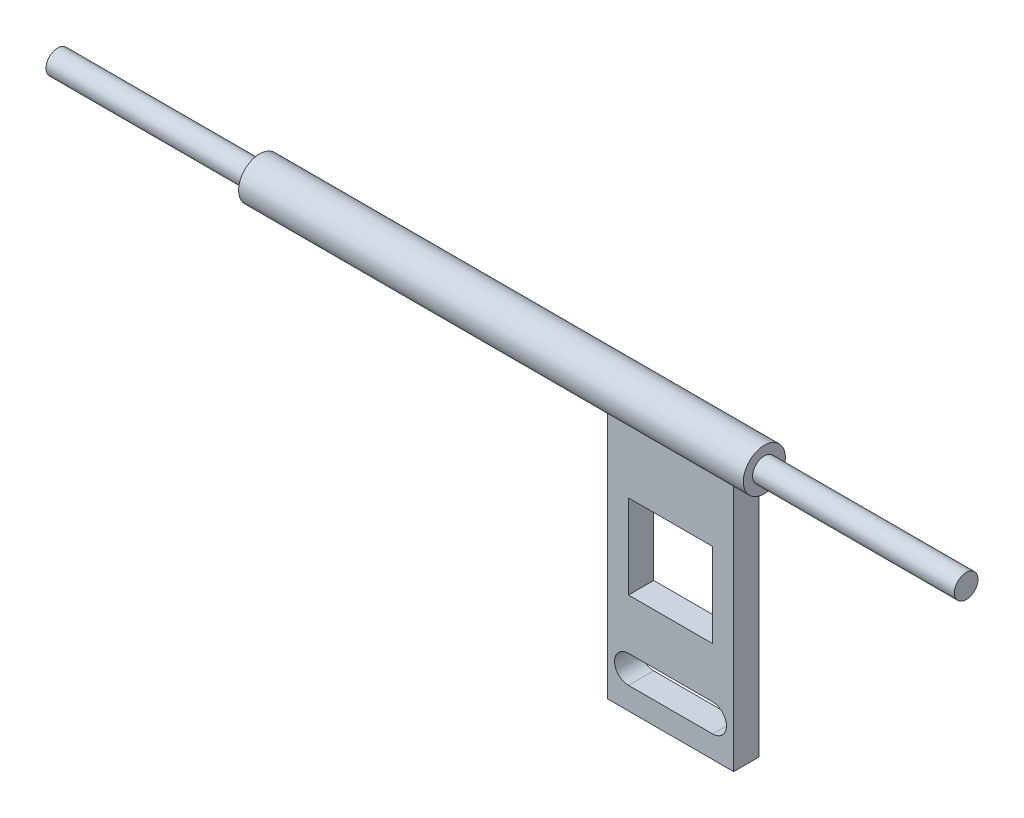
ISO-10303-21;
HEADER;
FILE_DESCRIPTION(('STEP AP214'),'2;1');
FILE_NAME('part.step','',(''),(''),'','','');
FILE_SCHEMA(('AUTOMOTIVE_DESIGN { 1 0 10303 214 1 1 1 1 }'));
ENDSEC;
DATA;
#1=APPLICATION_CONTEXT('core data for automotive mechanical design processes');
#2=APPLICATION_PROTOCOL_DEFINITION('international standard','automotive_design',2000,#1);
#3=PRODUCT_CONTEXT('',#1,'mechanical');
#4=PRODUCT('Part','Part','',(#3));
#5=PRODUCT_RELATED_PRODUCT_CATEGORY('part','',(#4));
#6=PRODUCT_DEFINITION_FORMATION('','',#4);
#7=PRODUCT_DEFINITION_CONTEXT('part definition',#1,'design');
#8=PRODUCT_DEFINITION('design','',#6,#7);
#9=PRODUCT_DEFINITION_SHAPE('','',#8);
#10=(LENGTH_UNIT() NAMED_UNIT(*) SI_UNIT(.MILLI.,.METRE.));
#11=(NAMED_UNIT(*) PLANE_ANGLE_UNIT() SI_UNIT($,.RADIAN.));
#12=(NAMED_UNIT(*) SI_UNIT($,.STERADIAN.) SOLID_ANGLE_UNIT());
#13=UNCERTAINTY_MEASURE_WITH_UNIT(LENGTH_MEASURE(1.E-05),#10,'distance_accuracy_value','');
#14=(GEOMETRIC_REPRESENTATION_CONTEXT(3) GLOBAL_UNCERTAINTY_ASSIGNED_CONTEXT((#13)) GLOBAL_UNIT_ASSIGNED_CONTEXT((#10,
#11,#12)) REPRESENTATION_CONTEXT('',''));
#15=CARTESIAN_POINT('',(0.,0.,0.));
#16=DIRECTION('',(0.,0.,1.));
#17=DIRECTION('',(1.,0.,0.));
#18=AXIS2_PLACEMENT_3D('',#15,#16,#17);
#19=CARTESIAN_POINT('',(0.,0.,-1.5));
#20=DIRECTION('',(0.,0.,1.));
#21=DIRECTION('',(1.,0.,0.));
#22=AXIS2_PLACEMENT_3D('',#19,#20,#21);
#23=PLANE('',#22);
#24=CARTESIAN_POINT('',(79.3460830467554,-27.15,-1.5));
#25=DIRECTION('',(0.,0.,1.));
#26=DIRECTION('',(1.,0.,0.));
#27=AXIS2_PLACEMENT_3D('',#24,#25,#26);
#28=CIRCLE('',#27,1.65);
#29=CARTESIAN_POINT('',(79.3460830467554,-25.5,-1.5));
#30=VERTEX_POINT('',#29);
#31=CARTESIAN_POINT('',(79.3460830467554,-28.8,-1.5));
#32=VERTEX_POINT('',#31);
#33=EDGE_CURVE('E188',#30,#32,#28,.F.);
#34=ORIENTED_EDGE('',*,*,#33,.F.);
#35=DIRECTION('',(1.,0.,0.));
#36=VECTOR('',#35,1.);
#37=CARTESIAN_POINT('',(0.,-25.5,-1.5));
#38=LINE('',#37,#36);
#39=CARTESIAN_POINT('',(69.3460830467554,-25.5,-1.5));
#40=VERTEX_POINT('',#39);
#41=EDGE_CURVE('E173',#40,#30,#38,.T.);
#42=ORIENTED_EDGE('',*,*,#41,.F.);
#43=CARTESIAN_POINT('',(69.3460830467554,-27.15,-1.5));
#44=DIRECTION('',(0.,0.,1.));
#45=DIRECTION('',(1.,0.,0.));
#46=AXIS2_PLACEMENT_3D('',#43,#44,#45);
#47=CIRCLE('',#46,1.65);
#48=CARTESIAN_POINT('',(69.3460830467554,-28.8,-1.5));
#49=VERTEX_POINT('',#48);
#50=EDGE_CURVE('E138',#49,#40,#47,.F.);
#51=ORIENTED_EDGE('',*,*,#50,.F.);
#52=DIRECTION('',(-1.,0.,0.));
#53=VECTOR('',#52,1.);
#54=CARTESIAN_POINT('',(0.,-28.8,-1.5));
#55=LINE('',#54,#53);
#56=EDGE_CURVE('E186',#32,#49,#55,.T.);
#57=ORIENTED_EDGE('',*,*,#56,.F.);
#58=EDGE_LOOP('',(#34,#42,#51,#57));
#59=FACE_BOUND('',#58,.T.);
#60=DIRECTION('',(0.,-1.,0.));
#61=VECTOR('',#60,1.);
#62=CARTESIAN_POINT('',(66.8460830467554,-1.4351175808838,-1.5));
#63=LINE('',#62,#61);
#64=CARTESIAN_POINT('',(66.8460830467554,-2.,-1.5));
#65=VERTEX_POINT('',#64);
#66=CARTESIAN_POINT('',(66.8460830467554,-31.4351175808838,-1.5));
#67=VERTEX_POINT('',#66);
#68=EDGE_CURVE('E204',#65,#67,#63,.T.);
#69=ORIENTED_EDGE('',*,*,#68,.F.);
#70=DIRECTION('',(-1.,0.,0.));
#71=VECTOR('',#70,1.);
#72=CARTESIAN_POINT('',(84.,-2.,-1.5));
#73=LINE('',#72,#71);
#74=CARTESIAN_POINT('',(81.8460830467554,-2.,-1.5));
#75=VERTEX_POINT('',#74);
#76=EDGE_CURVE('E131',#65,#75,#73,.F.);
#77=ORIENTED_EDGE('',*,*,#76,.T.);
#78=DIRECTION('',(0.,1.,0.));
#79=VECTOR('',#78,1.);
#80=CARTESIAN_POINT('',(81.8460830467554,-1.4351175808838,-1.5));
#81=LINE('',#80,#79);
#82=CARTESIAN_POINT('',(81.8460830467554,-31.4351175808838,-1.5));
#83=VERTEX_POINT('',#82);
#84=EDGE_CURVE('E209',#83,#75,#81,.T.);
#85=ORIENTED_EDGE('',*,*,#84,.F.);
#86=DIRECTION('',(1.,0.,0.));
#87=VECTOR('',#86,1.);
#88=CARTESIAN_POINT('',(66.8460830467554,-31.4351175808838,-1.5));
#89=LINE('',#88,#87);
#90=EDGE_CURVE('E206',#67,#83,#89,.T.);
#91=ORIENTED_EDGE('',*,*,#90,.F.);
#92=EDGE_LOOP('',(#69,#77,#85,#91));
#93=FACE_BOUND('',#92,.T.);
#94=DIRECTION('',(0.,-1.,0.));
#95=VECTOR('',#94,1.);
#96=CARTESIAN_POINT('',(79.3460830467554,0.,-1.5));
#97=LINE('',#96,#95);
#98=CARTESIAN_POINT('',(79.3460830467554,-9.5,-1.5));
#99=VERTEX_POINT('',#98);
#100=CARTESIAN_POINT('',(79.3460830467554,-19.5,-1.5));
#101=VERTEX_POINT('',#100);
#102=EDGE_CURVE('E172',#99,#101,#97,.T.);
#103=ORIENTED_EDGE('',*,*,#102,.F.);
#104=DIRECTION('',(1.,0.,0.));
#105=VECTOR('',#104,1.);
#106=CARTESIAN_POINT('',(0.,-9.5,-1.5));
#107=LINE('',#106,#105);
#108=CARTESIAN_POINT('',(69.3460830467555,-9.5,-1.5));
#109=VERTEX_POINT('',#108);
#110=EDGE_CURVE('E190',#109,#99,#107,.T.);
#111=ORIENTED_EDGE('',*,*,#110,.F.);
#112=DIRECTION('',(0.,1.,0.));
#113=VECTOR('',#112,1.);
#114=CARTESIAN_POINT('',(69.3460830467555,0.,-1.5));
#115=LINE('',#114,#113);
#116=CARTESIAN_POINT('',(69.3460830467555,-19.5,-1.5));
#117=VERTEX_POINT('',#116);
#118=EDGE_CURVE('E192',#117,#109,#115,.T.);
#119=ORIENTED_EDGE('',*,*,#118,.F.);
#120=DIRECTION('',(-1.,0.,0.));
#121=VECTOR('',#120,1.);
#122=CARTESIAN_POINT('',(0.,-19.5,-1.5));
#123=LINE('',#122,#121);
#124=EDGE_CURVE('E194',#101,#117,#123,.T.);
#125=ORIENTED_EDGE('',*,*,#124,.F.);
#126=EDGE_LOOP('',(#103,#111,#119,#125));
#127=FACE_BOUND('',#126,.T.);
#128=ADVANCED_FACE('F35',(#59,#93,#127),#23,.F.);
#129=CARTESIAN_POINT('',(0.,0.,1.5));
#130=DIRECTION('',(0.,0.,1.));
#131=DIRECTION('',(1.,0.,0.));
#132=AXIS2_PLACEMENT_3D('',#129,#130,#131);
#133=PLANE('',#132);
#134=DIRECTION('',(-1.,0.,0.));
#135=VECTOR('',#134,1.);
#136=CARTESIAN_POINT('',(84.,-2.,1.5));
#137=LINE('',#136,#135);
#138=CARTESIAN_POINT('',(66.8460830467554,-2.,1.5));
#139=VERTEX_POINT('',#138);
#140=CARTESIAN_POINT('',(81.8460830467554,-2.,1.5));
#141=VERTEX_POINT('',#140);
#142=EDGE_CURVE('E224',#139,#141,#137,.F.);
#143=ORIENTED_EDGE('',*,*,#142,.F.);
#144=DIRECTION('',(0.,-1.,0.));
#145=VECTOR('',#144,1.);
#146=CARTESIAN_POINT('',(66.8460830467554,-1.4351175808838,1.5));
#147=LINE('',#146,#145);
#148=CARTESIAN_POINT('',(66.8460830467554,-31.4351175808838,1.5));
#149=VERTEX_POINT('',#148);
#150=EDGE_CURVE('E197',#139,#149,#147,.T.);
#151=ORIENTED_EDGE('',*,*,#150,.T.);
#152=DIRECTION('',(1.,0.,0.));
#153=VECTOR('',#152,1.);
#154=CARTESIAN_POINT('',(66.8460830467554,-31.4351175808838,1.5));
#155=LINE('',#154,#153);
#156=CARTESIAN_POINT('',(81.8460830467554,-31.4351175808838,1.5));
#157=VERTEX_POINT('',#156);
#158=EDGE_CURVE('E199',#149,#157,#155,.T.);
#159=ORIENTED_EDGE('',*,*,#158,.T.);
#160=DIRECTION('',(0.,1.,0.));
#161=VECTOR('',#160,1.);
#162=CARTESIAN_POINT('',(81.8460830467554,-1.4351175808838,1.5));
#163=LINE('',#162,#161);
#164=EDGE_CURVE('E202',#157,#141,#163,.T.);
#165=ORIENTED_EDGE('',*,*,#164,.T.);
#166=EDGE_LOOP('',(#143,#151,#159,#165));
#167=FACE_BOUND('',#166,.T.);
#168=DIRECTION('',(1.,0.,0.));
#169=VECTOR('',#168,1.);
#170=CARTESIAN_POINT('',(0.,-25.5,1.5));
#171=LINE('',#170,#169);
#172=CARTESIAN_POINT('',(69.3460830467554,-25.5,1.5));
#173=VERTEX_POINT('',#172);
#174=CARTESIAN_POINT('',(79.3460830467554,-25.5,1.5));
#175=VERTEX_POINT('',#174);
#176=EDGE_CURVE('E122',#173,#175,#171,.T.);
#177=ORIENTED_EDGE('',*,*,#176,.T.);
#178=CARTESIAN_POINT('',(79.3460830467554,-27.15,1.5));
#179=DIRECTION('',(0.,0.,1.));
#180=DIRECTION('',(1.,0.,0.));
#181=AXIS2_PLACEMENT_3D('',#178,#179,#180);
#182=CIRCLE('',#181,1.65);
#183=CARTESIAN_POINT('',(79.3460830467554,-28.8,1.5));
#184=VERTEX_POINT('',#183);
#185=EDGE_CURVE('E147',#175,#184,#182,.F.);
#186=ORIENTED_EDGE('',*,*,#185,.T.);
#187=DIRECTION('',(-1.,0.,0.));
#188=VECTOR('',#187,1.);
#189=CARTESIAN_POINT('',(0.,-28.8,1.5));
#190=LINE('',#189,#188);
#191=CARTESIAN_POINT('',(69.3460830467554,-28.8,1.5));
#192=VERTEX_POINT('',#191);
#193=EDGE_CURVE('E145',#184,#192,#190,.T.);
#194=ORIENTED_EDGE('',*,*,#193,.T.);
#195=CARTESIAN_POINT('',(69.3460830467554,-27.15,1.5));
#196=DIRECTION('',(0.,0.,1.));
#197=DIRECTION('',(1.,0.,0.));
#198=AXIS2_PLACEMENT_3D('',#195,#196,#197);
#199=CIRCLE('',#198,1.65);
#200=EDGE_CURVE('E130',#192,#173,#199,.F.);
#201=ORIENTED_EDGE('',*,*,#200,.T.);
#202=EDGE_LOOP('',(#177,#186,#194,#201));
#203=FACE_BOUND('',#202,.T.);
#204=DIRECTION('',(1.,0.,0.));
#205=VECTOR('',#204,1.);
#206=CARTESIAN_POINT('',(0.,-9.5,1.5));
#207=LINE('',#206,#205);
#208=CARTESIAN_POINT('',(69.3460830467555,-9.5,1.5));
#209=VERTEX_POINT('',#208);
#210=CARTESIAN_POINT('',(79.3460830467554,-9.5,1.5));
#211=VERTEX_POINT('',#210);
#212=EDGE_CURVE('E152',#209,#211,#207,.T.);
#213=ORIENTED_EDGE('',*,*,#212,.T.);
#214=DIRECTION('',(0.,-1.,0.));
#215=VECTOR('',#214,1.);
#216=CARTESIAN_POINT('',(79.3460830467554,0.,1.5));
#217=LINE('',#216,#215);
#218=CARTESIAN_POINT('',(79.3460830467554,-19.5,1.5));
#219=VERTEX_POINT('',#218);
#220=EDGE_CURVE('E11',#211,#219,#217,.T.);
#221=ORIENTED_EDGE('',*,*,#220,.T.);
#222=DIRECTION('',(-1.,0.,0.));
#223=VECTOR('',#222,1.);
#224=CARTESIAN_POINT('',(0.,-19.5,1.5));
#225=LINE('',#224,#223);
#226=CARTESIAN_POINT('',(69.3460830467555,-19.5,1.5));
#227=VERTEX_POINT('',#226);
#228=EDGE_CURVE('E43',#219,#227,#225,.T.);
#229=ORIENTED_EDGE('',*,*,#228,.T.);
#230=DIRECTION('',(0.,1.,0.));
#231=VECTOR('',#230,1.);
#232=CARTESIAN_POINT('',(69.3460830467555,0.,1.5));
#233=LINE('',#232,#231);
#234=EDGE_CURVE('E155',#227,#209,#233,.T.);
#235=ORIENTED_EDGE('',*,*,#234,.T.);
#236=EDGE_LOOP('',(#213,#221,#229,#235));
#237=FACE_BOUND('',#236,.T.);
#238=ADVANCED_FACE('F143',(#167,#203,#237),#133,.T.);
#239=CARTESIAN_POINT('',(84.,0.,0.));
#240=DIRECTION('',(-1.,0.,0.));
#241=DIRECTION('',(0.,0.,1.));
#242=AXIS2_PLACEMENT_3D('',#239,#240,#241);
#243=CYLINDRICAL_SURFACE('',#242,2.5);
#244=CARTESIAN_POINT('',(24.,0.,0.));
#245=DIRECTION('',(1.,0.,0.));
#246=DIRECTION('',(0.,0.,-1.));
#247=AXIS2_PLACEMENT_3D('',#244,#245,#246);
#248=CIRCLE('',#247,2.5);
#249=CARTESIAN_POINT('',(24.,0.,-2.5));
#250=VERTEX_POINT('',#249);
#251=EDGE_CURVE('E220',#250,#250,#248,.T.);
#252=ORIENTED_EDGE('',*,*,#251,.T.);
#253=EDGE_LOOP('',(#252));
#254=FACE_BOUND('',#253,.T.);
#255=CARTESIAN_POINT('',(84.,0.,0.));
#256=DIRECTION('',(1.,0.,0.));
#257=DIRECTION('',(0.,0.,-1.));
#258=AXIS2_PLACEMENT_3D('',#255,#256,#257);
#259=CIRCLE('',#258,2.5);
#260=CARTESIAN_POINT('',(84.,0.,-2.5));
#261=VERTEX_POINT('',#260);
#262=EDGE_CURVE('E226',#261,#261,#259,.T.);
#263=ORIENTED_EDGE('',*,*,#262,.F.);
#264=EDGE_LOOP('',(#263));
#265=FACE_BOUND('',#264,.T.);
#266=ORIENTED_EDGE('',*,*,#76,.F.);
#267=CARTESIAN_POINT('',(66.8460830467554,0.,0.));
#268=DIRECTION('',(-1.,0.,0.));
#269=DIRECTION('',(0.,0.,1.));
#270=AXIS2_PLACEMENT_3D('',#267,#268,#269);
#271=CIRCLE('',#270,2.5);
#272=EDGE_CURVE('E241',#65,#139,#271,.T.);
#273=ORIENTED_EDGE('',*,*,#272,.T.);
#274=ORIENTED_EDGE('',*,*,#142,.T.);
#275=CARTESIAN_POINT('',(81.8460830467554,0.,0.));
#276=DIRECTION('',(1.,0.,0.));
#277=DIRECTION('',(0.,0.,-1.));
#278=AXIS2_PLACEMENT_3D('',#275,#276,#277);
#279=CIRCLE('',#278,2.5);
#280=EDGE_CURVE('E238',#141,#75,#279,.T.);
#281=ORIENTED_EDGE('',*,*,#280,.T.);
#282=EDGE_LOOP('',(#266,#273,#274,#281));
#283=FACE_BOUND('',#282,.T.);
#284=ADVANCED_FACE('F254',(#254,#265,#283),#243,.T.);
#285=CARTESIAN_POINT('',(24.,0.,0.));
#286=DIRECTION('',(-1.,0.,0.));
#287=DIRECTION('',(0.,0.,1.));
#288=AXIS2_PLACEMENT_3D('',#285,#286,#287);
#289=CYLINDRICAL_SURFACE('',#288,1.4);
#290=CARTESIAN_POINT('',(24.,0.,0.));
#291=DIRECTION('',(1.,0.,0.));
#292=DIRECTION('',(0.,0.,-1.));
#293=AXIS2_PLACEMENT_3D('',#290,#291,#292);
#294=CIRCLE('',#293,1.4);
#295=CARTESIAN_POINT('',(24.,0.,-1.4));
#296=VERTEX_POINT('',#295);
#297=EDGE_CURVE('E225',#296,#296,#294,.T.);
#298=ORIENTED_EDGE('',*,*,#297,.F.);
#299=EDGE_LOOP('',(#298));
#300=FACE_BOUND('',#299,.T.);
#301=CARTESIAN_POINT('',(0.,0.,0.));
#302=DIRECTION('',(1.,0.,0.));
#303=DIRECTION('',(0.,0.,-1.));
#304=AXIS2_PLACEMENT_3D('',#301,#302,#303);
#305=CIRCLE('',#304,1.4);
#306=CARTESIAN_POINT('',(0.,0.,-1.4));
#307=VERTEX_POINT('',#306);
#308=EDGE_CURVE('E229',#307,#307,#305,.T.);
#309=ORIENTED_EDGE('',*,*,#308,.T.);
#310=EDGE_LOOP('',(#309));
#311=FACE_BOUND('',#310,.T.);
#312=ADVANCED_FACE('F37',(#300,#311),#289,.T.);
#313=CARTESIAN_POINT('',(0.,0.,0.));
#314=DIRECTION('',(1.,0.,0.));
#315=DIRECTION('',(0.,0.,-1.));
#316=AXIS2_PLACEMENT_3D('',#313,#314,#315);
#317=PLANE('',#316);
#318=ORIENTED_EDGE('',*,*,#308,.F.);
#319=EDGE_LOOP('',(#318));
#320=FACE_BOUND('',#319,.T.);
#321=ADVANCED_FACE('F404',(#320),#317,.F.);
#322=CARTESIAN_POINT('',(84.,0.,0.));
#323=DIRECTION('',(1.,0.,0.));
#324=DIRECTION('',(0.,0.,-1.));
#325=AXIS2_PLACEMENT_3D('',#322,#323,#324);
#326=PLANE('',#325);
#327=CARTESIAN_POINT('',(84.,0.,0.));
#328=DIRECTION('',(1.,0.,0.));
#329=DIRECTION('',(0.,0.,-1.));
#330=AXIS2_PLACEMENT_3D('',#327,#328,#329);
#331=CIRCLE('',#330,1.4);
#332=CARTESIAN_POINT('',(84.,0.,-1.39999999999999));
#333=VERTEX_POINT('',#332);
#334=EDGE_CURVE('E221',#333,#333,#331,.T.);
#335=ORIENTED_EDGE('',*,*,#334,.F.);
#336=EDGE_LOOP('',(#335));
#337=FACE_BOUND('',#336,.T.);
#338=ORIENTED_EDGE('',*,*,#262,.T.);
#339=EDGE_LOOP('',(#338));
#340=FACE_BOUND('',#339,.T.);
#341=ADVANCED_FACE('F399',(#337,#340),#326,.T.);
#342=CARTESIAN_POINT('',(24.,0.,0.));
#343=DIRECTION('',(1.,0.,0.));
#344=DIRECTION('',(0.,0.,-1.));
#345=AXIS2_PLACEMENT_3D('',#342,#343,#344);
#346=PLANE('',#345);
#347=ORIENTED_EDGE('',*,*,#297,.T.);
#348=EDGE_LOOP('',(#347));
#349=FACE_BOUND('',#348,.T.);
#350=ORIENTED_EDGE('',*,*,#251,.F.);
#351=EDGE_LOOP('',(#350));
#352=FACE_BOUND('',#351,.T.);
#353=ADVANCED_FACE('F391',(#349,#352),#346,.F.);
#354=CARTESIAN_POINT('',(108.,0.,0.));
#355=DIRECTION('',(-1.,0.,0.));
#356=DIRECTION('',(0.,0.,1.));
#357=AXIS2_PLACEMENT_3D('',#354,#355,#356);
#358=CYLINDRICAL_SURFACE('',#357,1.4);
#359=CARTESIAN_POINT('',(108.,0.,0.));
#360=DIRECTION('',(1.,0.,0.));
#361=DIRECTION('',(0.,0.,-1.));
#362=AXIS2_PLACEMENT_3D('',#359,#360,#361);
#363=CIRCLE('',#362,1.4);
#364=CARTESIAN_POINT('',(108.,0.,-1.39999999999999));
#365=VERTEX_POINT('',#364);
#366=EDGE_CURVE('E215',#365,#365,#363,.T.);
#367=ORIENTED_EDGE('',*,*,#366,.F.);
#368=EDGE_LOOP('',(#367));
#369=FACE_BOUND('',#368,.T.);
#370=ORIENTED_EDGE('',*,*,#334,.T.);
#371=EDGE_LOOP('',(#370));
#372=FACE_BOUND('',#371,.T.);
#373=ADVANCED_FACE('F381',(#369,#372),#358,.T.);
#374=CARTESIAN_POINT('',(108.,0.,0.));
#375=DIRECTION('',(1.,0.,0.));
#376=DIRECTION('',(0.,0.,-1.));
#377=AXIS2_PLACEMENT_3D('',#374,#375,#376);
#378=PLANE('',#377);
#379=ORIENTED_EDGE('',*,*,#366,.T.);
#380=EDGE_LOOP('',(#379));
#381=FACE_BOUND('',#380,.T.);
#382=ADVANCED_FACE('F364',(#381),#378,.T.);
#383=CARTESIAN_POINT('',(66.8460830467554,-1.4351175808838,-1.5));
#384=DIRECTION('',(-1.,0.,0.));
#385=DIRECTION('',(0.,0.,1.));
#386=AXIS2_PLACEMENT_3D('',#383,#384,#385);
#387=PLANE('',#386);
#388=ORIENTED_EDGE('',*,*,#272,.F.);
#389=ORIENTED_EDGE('',*,*,#68,.T.);
#390=DIRECTION('',(0.,0.,1.));
#391=VECTOR('',#390,1.);
#392=CARTESIAN_POINT('',(66.8460830467554,-31.4351175808838,-1.5));
#393=LINE('',#392,#391);
#394=EDGE_CURVE('E212',#67,#149,#393,.T.);
#395=ORIENTED_EDGE('',*,*,#394,.T.);
#396=ORIENTED_EDGE('',*,*,#150,.F.);
#397=EDGE_LOOP('',(#388,#389,#395,#396));
#398=FACE_BOUND('',#397,.T.);
#399=ADVANCED_FACE('F258',(#398),#387,.T.);
#400=CARTESIAN_POINT('',(81.8460830467554,-1.4351175808838,-1.5));
#401=DIRECTION('',(1.,0.,0.));
#402=DIRECTION('',(0.,0.,-1.));
#403=AXIS2_PLACEMENT_3D('',#400,#401,#402);
#404=PLANE('',#403);
#405=ORIENTED_EDGE('',*,*,#280,.F.);
#406=ORIENTED_EDGE('',*,*,#164,.F.);
#407=DIRECTION('',(0.,0.,1.));
#408=VECTOR('',#407,1.);
#409=CARTESIAN_POINT('',(81.8460830467554,-31.4351175808838,-1.5));
#410=LINE('',#409,#408);
#411=EDGE_CURVE('E213',#83,#157,#410,.T.);
#412=ORIENTED_EDGE('',*,*,#411,.F.);
#413=ORIENTED_EDGE('',*,*,#84,.T.);
#414=EDGE_LOOP('',(#405,#406,#412,#413));
#415=FACE_BOUND('',#414,.T.);
#416=ADVANCED_FACE('F252',(#415),#404,.T.);
#417=CARTESIAN_POINT('',(66.8460830467554,-31.4351175808838,-1.5));
#418=DIRECTION('',(0.,-1.,0.));
#419=DIRECTION('',(0.,0.,-1.));
#420=AXIS2_PLACEMENT_3D('',#417,#418,#419);
#421=PLANE('',#420);
#422=ORIENTED_EDGE('',*,*,#411,.T.);
#423=ORIENTED_EDGE('',*,*,#158,.F.);
#424=ORIENTED_EDGE('',*,*,#394,.F.);
#425=ORIENTED_EDGE('',*,*,#90,.T.);
#426=EDGE_LOOP('',(#422,#423,#424,#425));
#427=FACE_BOUND('',#426,.T.);
#428=ADVANCED_FACE('F262',(#427),#421,.T.);
#429=CARTESIAN_POINT('',(79.3460830467554,-27.15,-11.5));
#430=DIRECTION('',(0.,0.,1.));
#431=DIRECTION('',(1.,0.,0.));
#432=AXIS2_PLACEMENT_3D('',#429,#430,#431);
#433=CYLINDRICAL_SURFACE('',#432,1.65);
#434=ORIENTED_EDGE('',*,*,#33,.T.);
#435=DIRECTION('',(0.,0.,1.));
#436=VECTOR('',#435,1.);
#437=CARTESIAN_POINT('',(79.3460830467554,-28.8,-11.5));
#438=LINE('',#437,#436);
#439=EDGE_CURVE('E181',#32,#184,#438,.T.);
#440=ORIENTED_EDGE('',*,*,#439,.T.);
#441=ORIENTED_EDGE('',*,*,#185,.F.);
#442=DIRECTION('',(0.,0.,1.));
#443=VECTOR('',#442,1.);
#444=CARTESIAN_POINT('',(79.3460830467554,-25.5,-11.5));
#445=LINE('',#444,#443);
#446=EDGE_CURVE('E125',#30,#175,#445,.T.);
#447=ORIENTED_EDGE('',*,*,#446,.F.);
#448=EDGE_LOOP('',(#434,#440,#441,#447));
#449=FACE_BOUND('',#448,.T.);
#450=ADVANCED_FACE('F264',(#449),#433,.F.);
#451=CARTESIAN_POINT('',(79.3460830467554,-28.8,-11.5));
#452=DIRECTION('',(0.,1.,0.));
#453=DIRECTION('',(0.,0.,1.));
#454=AXIS2_PLACEMENT_3D('',#451,#452,#453);
#455=PLANE('',#454);
#456=ORIENTED_EDGE('',*,*,#56,.T.);
#457=DIRECTION('',(0.,0.,1.));
#458=VECTOR('',#457,1.);
#459=CARTESIAN_POINT('',(69.3460830467554,-28.8,-11.5));
#460=LINE('',#459,#458);
#461=EDGE_CURVE('E140',#49,#192,#460,.T.);
#462=ORIENTED_EDGE('',*,*,#461,.T.);
#463=ORIENTED_EDGE('',*,*,#193,.F.);
#464=ORIENTED_EDGE('',*,*,#439,.F.);
#465=EDGE_LOOP('',(#456,#462,#463,#464));
#466=FACE_BOUND('',#465,.T.);
#467=ADVANCED_FACE('F270',(#466),#455,.T.);
#468=CARTESIAN_POINT('',(69.3460830467554,-27.15,-11.5));
#469=DIRECTION('',(0.,0.,1.));
#470=DIRECTION('',(1.,0.,0.));
#471=AXIS2_PLACEMENT_3D('',#468,#469,#470);
#472=CYLINDRICAL_SURFACE('',#471,1.65);
#473=ORIENTED_EDGE('',*,*,#50,.T.);
#474=DIRECTION('',(0.,0.,1.));
#475=VECTOR('',#474,1.);
#476=CARTESIAN_POINT('',(69.3460830467554,-25.5,-11.5));
#477=LINE('',#476,#475);
#478=EDGE_CURVE('E58',#40,#173,#477,.T.);
#479=ORIENTED_EDGE('',*,*,#478,.T.);
#480=ORIENTED_EDGE('',*,*,#200,.F.);
#481=ORIENTED_EDGE('',*,*,#461,.F.);
#482=EDGE_LOOP('',(#473,#479,#480,#481));
#483=FACE_BOUND('',#482,.T.);
#484=ADVANCED_FACE('F134',(#483),#472,.F.);
#485=CARTESIAN_POINT('',(79.3460830467554,-25.5,-11.5));
#486=DIRECTION('',(0.,-1.,0.));
#487=DIRECTION('',(0.,0.,-1.));
#488=AXIS2_PLACEMENT_3D('',#485,#486,#487);
#489=PLANE('',#488);
#490=ORIENTED_EDGE('',*,*,#41,.T.);
#491=ORIENTED_EDGE('',*,*,#446,.T.);
#492=ORIENTED_EDGE('',*,*,#176,.F.);
#493=ORIENTED_EDGE('',*,*,#478,.F.);
#494=EDGE_LOOP('',(#490,#491,#492,#493));
#495=FACE_BOUND('',#494,.T.);
#496=ADVANCED_FACE('F123',(#495),#489,.T.);
#497=CARTESIAN_POINT('',(79.3460830467554,-9.5,-11.5));
#498=DIRECTION('',(-1.,0.,0.));
#499=DIRECTION('',(0.,0.,1.));
#500=AXIS2_PLACEMENT_3D('',#497,#498,#499);
#501=PLANE('',#500);
#502=ORIENTED_EDGE('',*,*,#102,.T.);
#503=DIRECTION('',(0.,0.,1.));
#504=VECTOR('',#503,1.);
#505=CARTESIAN_POINT('',(79.3460830467554,-19.5,-11.5));
#506=LINE('',#505,#504);
#507=EDGE_CURVE('E164',#101,#219,#506,.T.);
#508=ORIENTED_EDGE('',*,*,#507,.T.);
#509=ORIENTED_EDGE('',*,*,#220,.F.);
#510=DIRECTION('',(0.,0.,1.));
#511=VECTOR('',#510,1.);
#512=CARTESIAN_POINT('',(79.3460830467554,-9.5,-11.5));
#513=LINE('',#512,#511);
#514=EDGE_CURVE('E183',#99,#211,#513,.T.);
#515=ORIENTED_EDGE('',*,*,#514,.F.);
#516=EDGE_LOOP('',(#502,#508,#509,#515));
#517=FACE_BOUND('',#516,.T.);
#518=ADVANCED_FACE('F169',(#517),#501,.T.);
#519=CARTESIAN_POINT('',(79.3460830467554,-19.5,-11.5));
#520=DIRECTION('',(0.,1.,0.));
#521=DIRECTION('',(-1.,0.,0.));
#522=AXIS2_PLACEMENT_3D('',#519,#520,#521);
#523=PLANE('',#522);
#524=ORIENTED_EDGE('',*,*,#124,.T.);
#525=DIRECTION('',(0.,0.,1.));
#526=VECTOR('',#525,1.);
#527=CARTESIAN_POINT('',(69.3460830467555,-19.5,-11.5));
#528=LINE('',#527,#526);
#529=EDGE_CURVE('E167',#117,#227,#528,.T.);
#530=ORIENTED_EDGE('',*,*,#529,.T.);
#531=ORIENTED_EDGE('',*,*,#228,.F.);
#532=ORIENTED_EDGE('',*,*,#507,.F.);
#533=EDGE_LOOP('',(#524,#530,#531,#532));
#534=FACE_BOUND('',#533,.T.);
#535=ADVANCED_FACE('F163',(#534),#523,.T.);
#536=CARTESIAN_POINT('',(69.3460830467555,-9.5,-11.5));
#537=DIRECTION('',(1.,0.,0.));
#538=DIRECTION('',(0.,0.,-1.));
#539=AXIS2_PLACEMENT_3D('',#536,#537,#538);
#540=PLANE('',#539);
#541=ORIENTED_EDGE('',*,*,#118,.T.);
#542=DIRECTION('',(0.,0.,1.));
#543=VECTOR('',#542,1.);
#544=CARTESIAN_POINT('',(69.3460830467555,-9.5,-11.5));
#545=LINE('',#544,#543);
#546=EDGE_CURVE('E50',#109,#209,#545,.T.);
#547=ORIENTED_EDGE('',*,*,#546,.T.);
#548=ORIENTED_EDGE('',*,*,#234,.F.);
#549=ORIENTED_EDGE('',*,*,#529,.F.);
#550=EDGE_LOOP('',(#541,#547,#548,#549));
#551=FACE_BOUND('',#550,.T.);
#552=ADVANCED_FACE('F295',(#551),#540,.T.);
#553=CARTESIAN_POINT('',(79.3460830467554,-9.5,-11.5));
#554=DIRECTION('',(0.,-1.,0.));
#555=DIRECTION('',(0.,0.,-1.));
#556=AXIS2_PLACEMENT_3D('',#553,#554,#555);
#557=PLANE('',#556);
#558=ORIENTED_EDGE('',*,*,#110,.T.);
#559=ORIENTED_EDGE('',*,*,#514,.T.);
#560=ORIENTED_EDGE('',*,*,#212,.F.);
#561=ORIENTED_EDGE('',*,*,#546,.F.);
#562=EDGE_LOOP('',(#558,#559,#560,#561));
#563=FACE_BOUND('',#562,.T.);
#564=ADVANCED_FACE('F298',(#563),#557,.T.);
#565=CLOSED_SHELL('',(#128,#238,#284,#312,#321,#341,#353,#373,#382,#399,#416,#428,#450,#467,
#484,#496,#518,#535,#552,#564));
#566=MANIFOLD_SOLID_BREP('B2',#565);
#567=ADVANCED_BREP_SHAPE_REPRESENTATION('',(#18,#566),#14);
#568=SHAPE_DEFINITION_REPRESENTATION(#9,#567);
ENDSEC;
END-ISO-10303-21;
